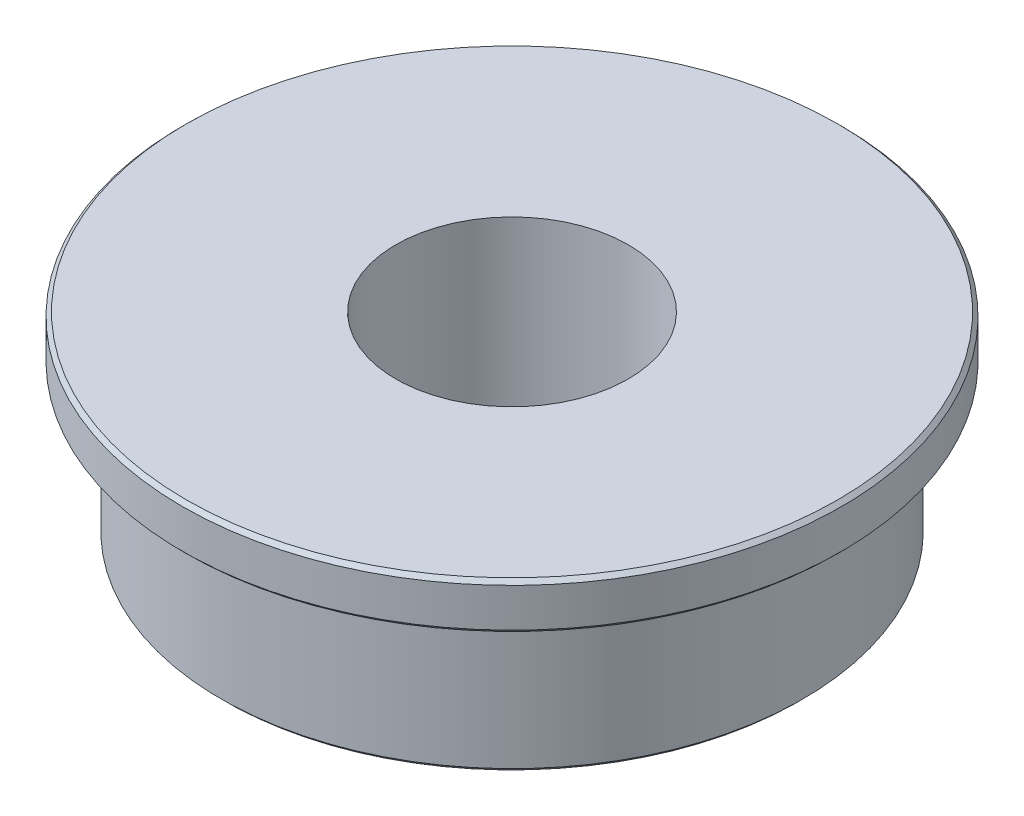
ISO-10303-21;
HEADER;
FILE_DESCRIPTION(('STEP AP214'),'2;1');
FILE_NAME('part.step','',(''),(''),'','','');
FILE_SCHEMA(('AUTOMOTIVE_DESIGN { 1 0 10303 214 1 1 1 1 }'));
ENDSEC;
DATA;
#1=APPLICATION_CONTEXT('core data for automotive mechanical design processes');
#2=APPLICATION_PROTOCOL_DEFINITION('international standard','automotive_design',2000,#1);
#3=PRODUCT_CONTEXT('',#1,'mechanical');
#4=PRODUCT('Part','Part','',(#3));
#5=PRODUCT_RELATED_PRODUCT_CATEGORY('part','',(#4));
#6=PRODUCT_DEFINITION_FORMATION('','',#4);
#7=PRODUCT_DEFINITION_CONTEXT('part definition',#1,'design');
#8=PRODUCT_DEFINITION('design','',#6,#7);
#9=PRODUCT_DEFINITION_SHAPE('','',#8);
#10=(LENGTH_UNIT() NAMED_UNIT(*) SI_UNIT(.MILLI.,.METRE.));
#11=(NAMED_UNIT(*) PLANE_ANGLE_UNIT() SI_UNIT($,.RADIAN.));
#12=(NAMED_UNIT(*) SI_UNIT($,.STERADIAN.) SOLID_ANGLE_UNIT());
#13=UNCERTAINTY_MEASURE_WITH_UNIT(LENGTH_MEASURE(1.E-05),#10,'distance_accuracy_value','');
#14=(GEOMETRIC_REPRESENTATION_CONTEXT(3) GLOBAL_UNCERTAINTY_ASSIGNED_CONTEXT((#13)) GLOBAL_UNIT_ASSIGNED_CONTEXT((#10,
#11,#12)) REPRESENTATION_CONTEXT('',''));
#15=CARTESIAN_POINT('',(0.,0.,0.));
#16=DIRECTION('',(0.,0.,1.));
#17=DIRECTION('',(1.,0.,0.));
#18=AXIS2_PLACEMENT_3D('',#15,#16,#17);
#19=CARTESIAN_POINT('',(7.5,0.,0.));
#20=DIRECTION('',(0.,-1.,0.));
#21=DIRECTION('',(0.,0.,-1.));
#22=AXIS2_PLACEMENT_3D('',#19,#20,#21);
#23=PLANE('',#22);
#24=CARTESIAN_POINT('',(0.,0.,0.));
#25=DIRECTION('',(0.,-1.,0.));
#26=DIRECTION('',(0.,0.,-1.));
#27=AXIS2_PLACEMENT_3D('',#24,#25,#26);
#28=CIRCLE('',#27,7.4);
#29=CARTESIAN_POINT('',(0.,0.,-7.4));
#30=VERTEX_POINT('',#29);
#31=EDGE_CURVE('E58',#30,#30,#28,.T.);
#32=ORIENTED_EDGE('',*,*,#31,.T.);
#33=EDGE_LOOP('',(#32));
#34=FACE_BOUND('',#33,.T.);
#35=CARTESIAN_POINT('',(0.,0.,0.));
#36=DIRECTION('',(0.,-1.,0.));
#37=DIRECTION('',(0.,0.,-1.));
#38=AXIS2_PLACEMENT_3D('',#35,#36,#37);
#39=CIRCLE('',#38,3.);
#40=CARTESIAN_POINT('',(0.,0.,-3.));
#41=VERTEX_POINT('',#40);
#42=EDGE_CURVE('E61',#41,#41,#39,.T.);
#43=ORIENTED_EDGE('',*,*,#42,.F.);
#44=EDGE_LOOP('',(#43));
#45=FACE_BOUND('',#44,.T.);
#46=ADVANCED_FACE('F34',(#34,#45),#23,.T.);
#47=CARTESIAN_POINT('',(0.,0.,0.));
#48=DIRECTION('',(0.,-1.,0.));
#49=DIRECTION('',(0.,0.,-1.));
#50=AXIS2_PLACEMENT_3D('',#47,#48,#49);
#51=CYLINDRICAL_SURFACE('',#50,3.);
#52=ORIENTED_EDGE('',*,*,#42,.T.);
#53=EDGE_LOOP('',(#52));
#54=FACE_BOUND('',#53,.T.);
#55=CARTESIAN_POINT('',(0.,5.,0.));
#56=DIRECTION('',(0.,-1.,0.));
#57=DIRECTION('',(0.,0.,-1.));
#58=AXIS2_PLACEMENT_3D('',#55,#56,#57);
#59=CIRCLE('',#58,3.);
#60=CARTESIAN_POINT('',(0.,5.,-3.));
#61=VERTEX_POINT('',#60);
#62=EDGE_CURVE('E64',#61,#61,#59,.T.);
#63=ORIENTED_EDGE('',*,*,#62,.F.);
#64=EDGE_LOOP('',(#63));
#65=FACE_BOUND('',#64,.T.);
#66=ADVANCED_FACE('F88',(#54,#65),#51,.F.);
#67=CARTESIAN_POINT('',(3.,5.,0.));
#68=DIRECTION('',(0.,1.,0.));
#69=DIRECTION('',(0.,0.,1.));
#70=AXIS2_PLACEMENT_3D('',#67,#68,#69);
#71=PLANE('',#70);
#72=CARTESIAN_POINT('',(0.,5.,0.));
#73=DIRECTION('',(0.,1.,0.));
#74=DIRECTION('',(0.,0.,1.));
#75=AXIS2_PLACEMENT_3D('',#72,#73,#74);
#76=CIRCLE('',#75,8.4);
#77=CARTESIAN_POINT('',(0.,5.,8.4));
#78=VERTEX_POINT('',#77);
#79=EDGE_CURVE('E10',#78,#78,#76,.T.);
#80=ORIENTED_EDGE('',*,*,#79,.T.);
#81=EDGE_LOOP('',(#80));
#82=FACE_BOUND('',#81,.T.);
#83=ORIENTED_EDGE('',*,*,#62,.T.);
#84=EDGE_LOOP('',(#83));
#85=FACE_BOUND('',#84,.T.);
#86=ADVANCED_FACE('F85',(#82,#85),#71,.T.);
#87=CARTESIAN_POINT('',(0.,0.,0.));
#88=DIRECTION('',(0.,-1.,0.));
#89=DIRECTION('',(0.,0.,-1.));
#90=AXIS2_PLACEMENT_3D('',#87,#88,#89);
#91=CYLINDRICAL_SURFACE('',#90,8.5);
#92=CARTESIAN_POINT('',(0.,3.9,0.));
#93=DIRECTION('',(0.,-1.,0.));
#94=DIRECTION('',(0.,0.,-1.));
#95=AXIS2_PLACEMENT_3D('',#92,#93,#94);
#96=CIRCLE('',#95,8.5);
#97=CARTESIAN_POINT('',(0.,3.9,-8.5));
#98=VERTEX_POINT('',#97);
#99=EDGE_CURVE('E42',#98,#98,#96,.F.);
#100=ORIENTED_EDGE('',*,*,#99,.T.);
#101=EDGE_LOOP('',(#100));
#102=FACE_BOUND('',#101,.T.);
#103=CARTESIAN_POINT('',(0.,4.9,0.));
#104=DIRECTION('',(0.,1.,0.));
#105=DIRECTION('',(0.,0.,1.));
#106=AXIS2_PLACEMENT_3D('',#103,#104,#105);
#107=CIRCLE('',#106,8.5);
#108=CARTESIAN_POINT('',(0.,4.9,8.5));
#109=VERTEX_POINT('',#108);
#110=EDGE_CURVE('E46',#109,#109,#107,.F.);
#111=ORIENTED_EDGE('',*,*,#110,.T.);
#112=EDGE_LOOP('',(#111));
#113=FACE_BOUND('',#112,.T.);
#114=ADVANCED_FACE('F75',(#102,#113),#91,.T.);
#115=CARTESIAN_POINT('',(8.5,3.8,0.));
#116=DIRECTION('',(0.,-1.,0.));
#117=DIRECTION('',(0.,0.,-1.));
#118=AXIS2_PLACEMENT_3D('',#115,#116,#117);
#119=PLANE('',#118);
#120=CARTESIAN_POINT('',(0.,3.8,0.));
#121=DIRECTION('',(0.,-1.,0.));
#122=DIRECTION('',(0.,0.,-1.));
#123=AXIS2_PLACEMENT_3D('',#120,#121,#122);
#124=CIRCLE('',#123,8.4);
#125=CARTESIAN_POINT('',(0.,3.8,-8.4));
#126=VERTEX_POINT('',#125);
#127=EDGE_CURVE('E50',#126,#126,#124,.T.);
#128=ORIENTED_EDGE('',*,*,#127,.T.);
#129=EDGE_LOOP('',(#128));
#130=FACE_BOUND('',#129,.T.);
#131=CARTESIAN_POINT('',(0.,3.8,0.));
#132=DIRECTION('',(0.,-1.,0.));
#133=DIRECTION('',(0.,0.,-1.));
#134=AXIS2_PLACEMENT_3D('',#131,#132,#133);
#135=CIRCLE('',#134,7.5);
#136=CARTESIAN_POINT('',(0.,3.8,-7.5));
#137=VERTEX_POINT('',#136);
#138=EDGE_CURVE('E67',#137,#137,#135,.T.);
#139=ORIENTED_EDGE('',*,*,#138,.F.);
#140=EDGE_LOOP('',(#139));
#141=FACE_BOUND('',#140,.T.);
#142=ADVANCED_FACE('F73',(#130,#141),#119,.T.);
#143=CARTESIAN_POINT('',(0.,0.,0.));
#144=DIRECTION('',(0.,-1.,0.));
#145=DIRECTION('',(0.,0.,-1.));
#146=AXIS2_PLACEMENT_3D('',#143,#144,#145);
#147=CYLINDRICAL_SURFACE('',#146,7.5);
#148=CARTESIAN_POINT('',(0.,0.0999999999999971,0.));
#149=DIRECTION('',(0.,-1.,0.));
#150=DIRECTION('',(0.,0.,-1.));
#151=AXIS2_PLACEMENT_3D('',#148,#149,#150);
#152=CIRCLE('',#151,7.5);
#153=CARTESIAN_POINT('',(0.,0.0999999999999971,-7.5));
#154=VERTEX_POINT('',#153);
#155=EDGE_CURVE('E55',#154,#154,#152,.F.);
#156=ORIENTED_EDGE('',*,*,#155,.T.);
#157=EDGE_LOOP('',(#156));
#158=FACE_BOUND('',#157,.T.);
#159=ORIENTED_EDGE('',*,*,#138,.T.);
#160=EDGE_LOOP('',(#159));
#161=FACE_BOUND('',#160,.T.);
#162=ADVANCED_FACE('F71',(#158,#161),#147,.T.);
#163=CARTESIAN_POINT('',(0.,0.,0.));
#164=DIRECTION('',(0.,1.,0.));
#165=DIRECTION('',(0.,0.,1.));
#166=AXIS2_PLACEMENT_3D('',#163,#164,#165);
#167=CONICAL_SURFACE('',#166,7.4,0.785398163397457);
#168=ORIENTED_EDGE('',*,*,#155,.F.);
#169=EDGE_LOOP('',(#168));
#170=FACE_BOUND('',#169,.T.);
#171=ORIENTED_EDGE('',*,*,#31,.F.);
#172=EDGE_LOOP('',(#171));
#173=FACE_BOUND('',#172,.T.);
#174=ADVANCED_FACE('F82',(#170,#173),#167,.T.);
#175=CARTESIAN_POINT('',(0.,3.8,0.));
#176=DIRECTION('',(0.,1.,0.));
#177=DIRECTION('',(0.,0.,1.));
#178=AXIS2_PLACEMENT_3D('',#175,#176,#177);
#179=CONICAL_SURFACE('',#178,8.4,0.78539816339744);
#180=ORIENTED_EDGE('',*,*,#99,.F.);
#181=EDGE_LOOP('',(#180));
#182=FACE_BOUND('',#181,.T.);
#183=ORIENTED_EDGE('',*,*,#127,.F.);
#184=EDGE_LOOP('',(#183));
#185=FACE_BOUND('',#184,.T.);
#186=ADVANCED_FACE('F104',(#182,#185),#179,.T.);
#187=CARTESIAN_POINT('',(0.,4.9,0.));
#188=DIRECTION('',(0.,-1.,0.));
#189=DIRECTION('',(0.,0.,-1.));
#190=AXIS2_PLACEMENT_3D('',#187,#188,#189);
#191=CONICAL_SURFACE('',#190,8.5,0.78539816339744);
#192=ORIENTED_EDGE('',*,*,#79,.F.);
#193=EDGE_LOOP('',(#192));
#194=FACE_BOUND('',#193,.T.);
#195=ORIENTED_EDGE('',*,*,#110,.F.);
#196=EDGE_LOOP('',(#195));
#197=FACE_BOUND('',#196,.T.);
#198=ADVANCED_FACE('F37',(#194,#197),#191,.T.);
#199=CLOSED_SHELL('',(#46,#66,#86,#114,#142,#162,#174,#186,#198));
#200=MANIFOLD_SOLID_BREP('B2',#199);
#201=ADVANCED_BREP_SHAPE_REPRESENTATION('',(#18,#200),#14);
#202=SHAPE_DEFINITION_REPRESENTATION(#9,#201);
ENDSEC;
END-ISO-10303-21;
